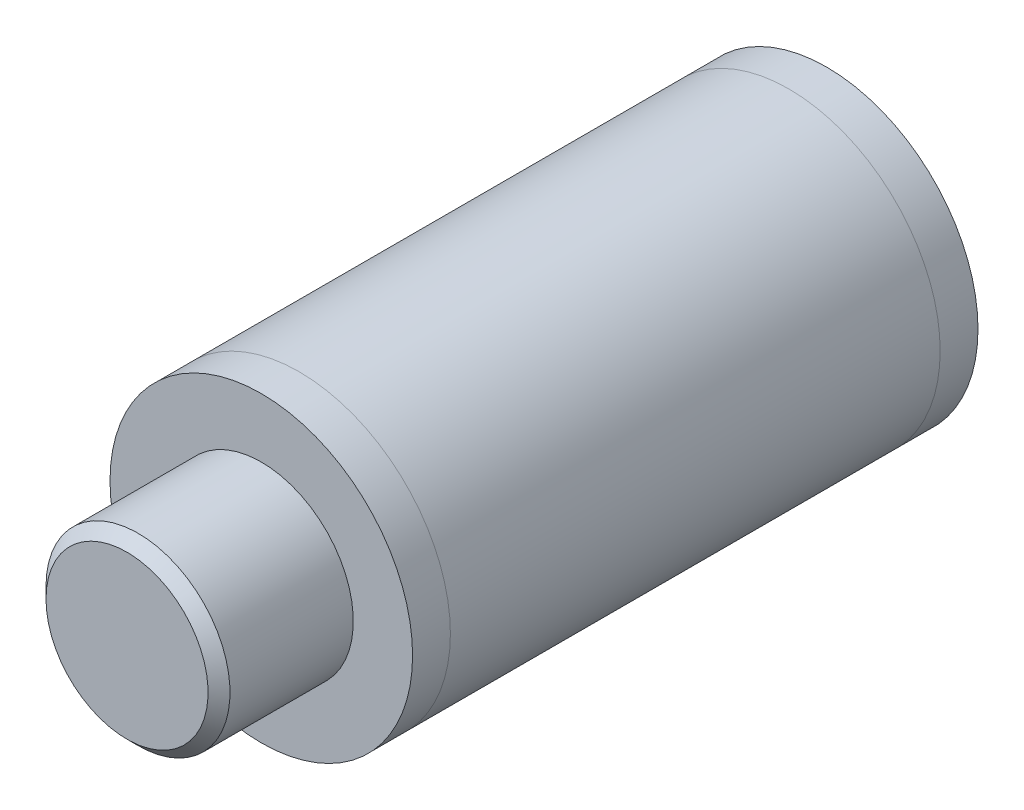
ISO-10303-21;
HEADER;
FILE_DESCRIPTION(('STEP AP214'),'2;1');
FILE_NAME('part.step','',(''),(''),'','','');
FILE_SCHEMA(('AUTOMOTIVE_DESIGN { 1 0 10303 214 1 1 1 1 }'));
ENDSEC;
DATA;
#1=APPLICATION_CONTEXT('core data for automotive mechanical design processes');
#2=APPLICATION_PROTOCOL_DEFINITION('international standard','automotive_design',2000,#1);
#3=PRODUCT_CONTEXT('',#1,'mechanical');
#4=PRODUCT('Part','Part','',(#3));
#5=PRODUCT_RELATED_PRODUCT_CATEGORY('part','',(#4));
#6=PRODUCT_DEFINITION_FORMATION('','',#4);
#7=PRODUCT_DEFINITION_CONTEXT('part definition',#1,'design');
#8=PRODUCT_DEFINITION('design','',#6,#7);
#9=PRODUCT_DEFINITION_SHAPE('','',#8);
#10=(LENGTH_UNIT() NAMED_UNIT(*) SI_UNIT(.MILLI.,.METRE.));
#11=(NAMED_UNIT(*) PLANE_ANGLE_UNIT() SI_UNIT($,.RADIAN.));
#12=(NAMED_UNIT(*) SI_UNIT($,.STERADIAN.) SOLID_ANGLE_UNIT());
#13=UNCERTAINTY_MEASURE_WITH_UNIT(LENGTH_MEASURE(1.E-05),#10,'distance_accuracy_value','');
#14=(GEOMETRIC_REPRESENTATION_CONTEXT(3) GLOBAL_UNCERTAINTY_ASSIGNED_CONTEXT((#13)) GLOBAL_UNIT_ASSIGNED_CONTEXT((#10,
#11,#12)) REPRESENTATION_CONTEXT('',''));
#15=CARTESIAN_POINT('',(0.,0.,0.));
#16=DIRECTION('',(0.,0.,1.));
#17=DIRECTION('',(1.,0.,0.));
#18=AXIS2_PLACEMENT_3D('',#15,#16,#17);
#19=CARTESIAN_POINT('',(0.,0.,29.9));
#20=DIRECTION('',(0.,0.,-1.));
#21=DIRECTION('',(-1.,0.,0.));
#22=AXIS2_PLACEMENT_3D('',#19,#20,#21);
#23=CYLINDRICAL_SURFACE('',#22,8.);
#24=CARTESIAN_POINT('',(0.,0.,0.));
#25=DIRECTION('',(0.,0.,-1.));
#26=DIRECTION('',(-1.,0.,0.));
#27=AXIS2_PLACEMENT_3D('',#24,#25,#26);
#28=CIRCLE('',#27,8.);
#29=CARTESIAN_POINT('',(-8.,0.,0.));
#30=VERTEX_POINT('',#29);
#31=EDGE_CURVE('E52',#30,#30,#28,.T.);
#32=ORIENTED_EDGE('',*,*,#31,.F.);
#33=EDGE_LOOP('',(#32));
#34=FACE_BOUND('',#33,.T.);
#35=CARTESIAN_POINT('',(0.,0.,2.));
#36=DIRECTION('',(0.,0.,-1.));
#37=DIRECTION('',(-1.,0.,0.));
#38=AXIS2_PLACEMENT_3D('',#35,#36,#37);
#39=CIRCLE('',#38,8.);
#40=CARTESIAN_POINT('',(-8.,0.,2.));
#41=VERTEX_POINT('',#40);
#42=EDGE_CURVE('E11',#41,#41,#39,.T.);
#43=ORIENTED_EDGE('',*,*,#42,.T.);
#44=EDGE_LOOP('',(#43));
#45=FACE_BOUND('',#44,.T.);
#46=ADVANCED_FACE('F37',(#34,#45),#23,.T.);
#47=CARTESIAN_POINT('',(0.,0.,29.9));
#48=DIRECTION('',(0.,0.,-1.));
#49=DIRECTION('',(-1.,0.,0.));
#50=AXIS2_PLACEMENT_3D('',#47,#48,#49);
#51=CIRCLE('',#50,8.);
#52=CARTESIAN_POINT('',(-8.,0.,29.9));
#53=VERTEX_POINT('',#52);
#54=EDGE_CURVE('E57',#53,#53,#51,.T.);
#55=ORIENTED_EDGE('',*,*,#54,.T.);
#56=EDGE_LOOP('',(#55));
#57=FACE_BOUND('',#56,.T.);
#58=CARTESIAN_POINT('',(0.,0.,27.9));
#59=DIRECTION('',(0.,0.,1.));
#60=DIRECTION('',(1.,0.,0.));
#61=AXIS2_PLACEMENT_3D('',#58,#59,#60);
#62=CIRCLE('',#61,8.);
#63=CARTESIAN_POINT('',(8.,0.,27.9));
#64=VERTEX_POINT('',#63);
#65=EDGE_CURVE('E44',#64,#64,#62,.T.);
#66=ORIENTED_EDGE('',*,*,#65,.T.);
#67=EDGE_LOOP('',(#66));
#68=FACE_BOUND('',#67,.T.);
#69=ADVANCED_FACE('F80',(#57,#68),#23,.T.);
#70=CARTESIAN_POINT('',(8.,0.,29.9));
#71=DIRECTION('',(0.,0.,-1.));
#72=DIRECTION('',(-1.,0.,0.));
#73=AXIS2_PLACEMENT_3D('',#70,#71,#72);
#74=PLANE('',#73);
#75=ORIENTED_EDGE('',*,*,#54,.F.);
#76=EDGE_LOOP('',(#75));
#77=FACE_BOUND('',#76,.T.);
#78=CARTESIAN_POINT('',(0.,0.,29.9));
#79=DIRECTION('',(0.,0.,-1.));
#80=DIRECTION('',(-1.,0.,0.));
#81=AXIS2_PLACEMENT_3D('',#78,#79,#80);
#82=CIRCLE('',#81,4.865);
#83=CARTESIAN_POINT('',(-4.86500000000001,0.,29.9));
#84=VERTEX_POINT('',#83);
#85=EDGE_CURVE('E48',#84,#84,#82,.F.);
#86=ORIENTED_EDGE('',*,*,#85,.F.);
#87=EDGE_LOOP('',(#86));
#88=FACE_BOUND('',#87,.T.);
#89=ADVANCED_FACE('F87',(#77,#88),#74,.F.);
#90=CARTESIAN_POINT('',(0.,0.,0.));
#91=DIRECTION('',(0.,0.,1.));
#92=DIRECTION('',(1.,0.,0.));
#93=AXIS2_PLACEMENT_3D('',#90,#91,#92);
#94=PLANE('',#93);
#95=ORIENTED_EDGE('',*,*,#31,.T.);
#96=EDGE_LOOP('',(#95));
#97=FACE_BOUND('',#96,.T.);
#98=ADVANCED_FACE('F39',(#97),#94,.F.);
#99=ORIENTED_EDGE('',*,*,#42,.F.);
#100=EDGE_LOOP('',(#99));
#101=FACE_BOUND('',#100,.T.);
#102=ORIENTED_EDGE('',*,*,#65,.F.);
#103=EDGE_LOOP('',(#102));
#104=FACE_BOUND('',#103,.T.);
#105=ADVANCED_FACE('F82',(#101,#104),#23,.T.);
#106=CARTESIAN_POINT('',(0.,0.,37.));
#107=DIRECTION('',(0.,0.,-1.));
#108=DIRECTION('',(-1.,0.,0.));
#109=AXIS2_PLACEMENT_3D('',#106,#107,#108);
#110=CYLINDRICAL_SURFACE('',#109,4.865);
#111=ORIENTED_EDGE('',*,*,#85,.T.);
#112=EDGE_LOOP('',(#111));
#113=FACE_BOUND('',#112,.T.);
#114=CARTESIAN_POINT('',(0.,0.,36.42));
#115=DIRECTION('',(0.,0.,-1.));
#116=DIRECTION('',(-1.,0.,0.));
#117=AXIS2_PLACEMENT_3D('',#114,#115,#116);
#118=CIRCLE('',#117,4.865);
#119=CARTESIAN_POINT('',(-4.865,0.,36.42));
#120=VERTEX_POINT('',#119);
#121=EDGE_CURVE('E60',#120,#120,#118,.T.);
#122=ORIENTED_EDGE('',*,*,#121,.T.);
#123=EDGE_LOOP('',(#122));
#124=FACE_BOUND('',#123,.T.);
#125=ADVANCED_FACE('F76',(#113,#124),#110,.T.);
#126=CARTESIAN_POINT('',(0.,0.,37.));
#127=DIRECTION('',(0.,0.,-1.));
#128=DIRECTION('',(-1.,0.,0.));
#129=AXIS2_PLACEMENT_3D('',#126,#127,#128);
#130=CONICAL_SURFACE('',#129,4.285,0.785398163397452);
#131=ORIENTED_EDGE('',*,*,#121,.F.);
#132=EDGE_LOOP('',(#131));
#133=FACE_BOUND('',#132,.T.);
#134=CARTESIAN_POINT('',(0.,0.,37.));
#135=DIRECTION('',(0.,0.,-1.));
#136=DIRECTION('',(-1.,0.,0.));
#137=AXIS2_PLACEMENT_3D('',#134,#135,#136);
#138=CIRCLE('',#137,4.285);
#139=CARTESIAN_POINT('',(-4.285,0.,37.));
#140=VERTEX_POINT('',#139);
#141=EDGE_CURVE('E63',#140,#140,#138,.T.);
#142=ORIENTED_EDGE('',*,*,#141,.T.);
#143=EDGE_LOOP('',(#142));
#144=FACE_BOUND('',#143,.T.);
#145=ADVANCED_FACE('F67',(#133,#144),#130,.T.);
#146=CARTESIAN_POINT('',(4.285,0.,37.));
#147=DIRECTION('',(0.,0.,-1.));
#148=DIRECTION('',(-1.,0.,0.));
#149=AXIS2_PLACEMENT_3D('',#146,#147,#148);
#150=PLANE('',#149);
#151=ORIENTED_EDGE('',*,*,#141,.F.);
#152=EDGE_LOOP('',(#151));
#153=FACE_BOUND('',#152,.T.);
#154=ADVANCED_FACE('F69',(#153),#150,.F.);
#155=CLOSED_SHELL('',(#46,#69,#89,#98,#105,#125,#145,#154));
#156=MANIFOLD_SOLID_BREP('B2',#155);
#157=ADVANCED_BREP_SHAPE_REPRESENTATION('',(#18,#156),#14);
#158=SHAPE_DEFINITION_REPRESENTATION(#9,#157);
ENDSEC;
END-ISO-10303-21;
